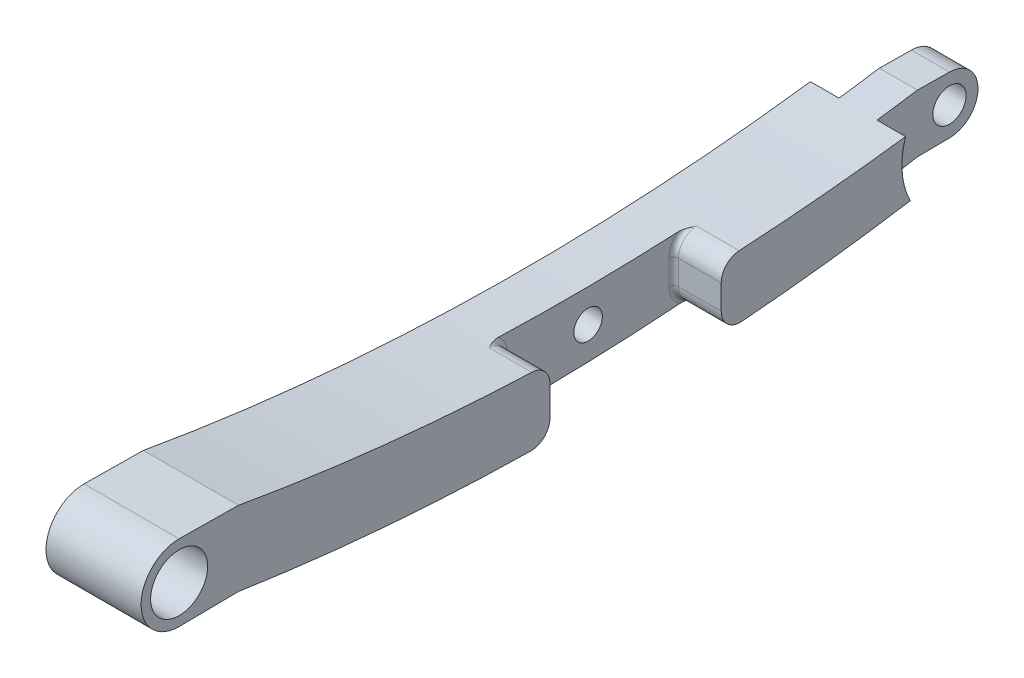
ISO-10303-21;
HEADER;
FILE_DESCRIPTION(('STEP AP214'),'2;1');
FILE_NAME('part.step','',(''),(''),'','','');
FILE_SCHEMA(('AUTOMOTIVE_DESIGN { 1 0 10303 214 1 1 1 1 }'));
ENDSEC;
DATA;
#1=APPLICATION_CONTEXT('core data for automotive mechanical design processes');
#2=APPLICATION_PROTOCOL_DEFINITION('international standard','automotive_design',2000,#1);
#3=PRODUCT_CONTEXT('',#1,'mechanical');
#4=PRODUCT('Part','Part','',(#3));
#5=PRODUCT_RELATED_PRODUCT_CATEGORY('part','',(#4));
#6=PRODUCT_DEFINITION_FORMATION('','',#4);
#7=PRODUCT_DEFINITION_CONTEXT('part definition',#1,'design');
#8=PRODUCT_DEFINITION('design','',#6,#7);
#9=PRODUCT_DEFINITION_SHAPE('','',#8);
#10=(LENGTH_UNIT() NAMED_UNIT(*) SI_UNIT(.MILLI.,.METRE.));
#11=(NAMED_UNIT(*) PLANE_ANGLE_UNIT() SI_UNIT($,.RADIAN.));
#12=(NAMED_UNIT(*) SI_UNIT($,.STERADIAN.) SOLID_ANGLE_UNIT());
#13=UNCERTAINTY_MEASURE_WITH_UNIT(LENGTH_MEASURE(1.E-05),#10,'distance_accuracy_value','');
#14=(GEOMETRIC_REPRESENTATION_CONTEXT(3) GLOBAL_UNCERTAINTY_ASSIGNED_CONTEXT((#13)) GLOBAL_UNIT_ASSIGNED_CONTEXT((#10,
#11,#12)) REPRESENTATION_CONTEXT('',''));
#15=CARTESIAN_POINT('',(0.,0.,0.));
#16=DIRECTION('',(0.,0.,1.));
#17=DIRECTION('',(1.,0.,0.));
#18=AXIS2_PLACEMENT_3D('',#15,#16,#17);
#19=CARTESIAN_POINT('',(10.,5.99925691325484,85.4744706411542));
#20=DIRECTION('',(1.,0.,0.));
#21=DIRECTION('',(0.,0.,-1.));
#22=AXIS2_PLACEMENT_3D('',#19,#20,#21);
#23=PLANE('',#22);
#24=DIRECTION('',(0.,1.,0.));
#25=VECTOR('',#24,1.);
#26=CARTESIAN_POINT('',(10.,-0.527832467467765,46.4744706411542));
#27=LINE('',#26,#25);
#28=CARTESIAN_POINT('',(10.,1.50267477132526,46.4744706411542));
#29=VERTEX_POINT('',#28);
#30=CARTESIAN_POINT('',(10.,4.61793473640981,46.4744706411542));
#31=VERTEX_POINT('',#30);
#32=EDGE_CURVE('E245',#29,#31,#27,.T.);
#33=ORIENTED_EDGE('',*,*,#32,.T.);
#34=CARTESIAN_POINT('',(10.,4.61793473640981,48.4744706411542));
#35=DIRECTION('',(1.,0.,0.));
#36=DIRECTION('',(0.,0.,-1.));
#37=AXIS2_PLACEMENT_3D('',#34,#35,#36);
#38=CIRCLE('',#37,2.);
#39=CARTESIAN_POINT('',(10.,6.61638429736786,48.3957346753792));
#40=VERTEX_POINT('',#39);
#41=EDGE_CURVE('E257',#31,#40,#38,.T.);
#42=ORIENTED_EDGE('',*,*,#41,.T.);
#43=CARTESIAN_POINT('',(10.,236.438083807545,39.3410986112443));
#44=DIRECTION('',(-1.,0.,0.));
#45=DIRECTION('',(0.,0.,1.));
#46=AXIS2_PLACEMENT_3D('',#43,#44,#45);
#47=CIRCLE('',#46,230.);
#48=CARTESIAN_POINT('',(10.,9.92502379326693,79.2388885621695));
#49=VERTEX_POINT('',#48);
#50=EDGE_CURVE('E417',#40,#49,#47,.T.);
#51=ORIENTED_EDGE('',*,*,#50,.T.);
#52=DIRECTION('',(0.,0.0119039184030142,0.999929145853172));
#53=VECTOR('',#52,1.);
#54=CARTESIAN_POINT('',(10.,9.99925691325485,85.4744706411542));
#55=LINE('',#54,#53);
#56=CARTESIAN_POINT('',(10.,9.99925691325485,85.4744706411542));
#57=VERTEX_POINT('',#56);
#58=EDGE_CURVE('E419',#49,#57,#55,.T.);
#59=ORIENTED_EDGE('',*,*,#58,.T.);
#60=CARTESIAN_POINT('',(10.,5.99925691325484,85.4744706411542));
#61=DIRECTION('',(1.,0.,0.));
#62=DIRECTION('',(0.,0.,-1.));
#63=AXIS2_PLACEMENT_3D('',#60,#61,#62);
#64=CIRCLE('',#63,4.);
#65=CARTESIAN_POINT('',(10.,1.99925691325484,85.4744706411542));
#66=VERTEX_POINT('',#65);
#67=EDGE_CURVE('E407',#57,#66,#64,.T.);
#68=ORIENTED_EDGE('',*,*,#67,.T.);
#69=DIRECTION('',(0.,0.0119039184030131,-0.999929145853172));
#70=VECTOR('',#69,1.);
#71=CARTESIAN_POINT('',(10.,1.99925691325484,85.4744706411542));
#72=LINE('',#71,#70);
#73=CARTESIAN_POINT('',(10.,2.07349003324278,79.2388885621696));
#74=VERTEX_POINT('',#73);
#75=EDGE_CURVE('E410',#66,#74,#72,.T.);
#76=ORIENTED_EDGE('',*,*,#75,.T.);
#77=CARTESIAN_POINT('',(10.,229.472167532532,44.7448097721201));
#78=DIRECTION('',(1.,0.,0.));
#79=DIRECTION('',(0.,0.,-1.));
#80=AXIS2_PLACEMENT_3D('',#77,#78,#79);
#81=CIRCLE('',#80,230.);
#82=CARTESIAN_POINT('',(10.,-0.49705762131691,48.5071869645668));
#83=VERTEX_POINT('',#82);
#84=EDGE_CURVE('E414',#74,#83,#81,.T.);
#85=ORIENTED_EDGE('',*,*,#84,.T.);
#86=CARTESIAN_POINT('',(10.,1.50267477132526,48.4744706411542));
#87=DIRECTION('',(1.,0.,0.));
#88=DIRECTION('',(0.,0.,-1.));
#89=AXIS2_PLACEMENT_3D('',#86,#87,#88);
#90=CIRCLE('',#89,2.);
#91=EDGE_CURVE('E255',#83,#29,#90,.T.);
#92=ORIENTED_EDGE('',*,*,#91,.T.);
#93=EDGE_LOOP('',(#33,#42,#51,#59,#68,#76,#85,#92));
#94=FACE_BOUND('',#93,.T.);
#95=CARTESIAN_POINT('',(10.,5.99925691325484,85.4744706411542));
#96=DIRECTION('',(1.,0.,0.));
#97=DIRECTION('',(0.,0.,-1.));
#98=AXIS2_PLACEMENT_3D('',#95,#96,#97);
#99=CIRCLE('',#98,2.99999999999999);
#100=CARTESIAN_POINT('',(10.,5.99925691325484,82.4744706411543));
#101=VERTEX_POINT('',#100);
#102=EDGE_CURVE('E398',#101,#101,#99,.T.);
#103=ORIENTED_EDGE('',*,*,#102,.F.);
#104=EDGE_LOOP('',(#103));
#105=FACE_BOUND('',#104,.T.);
#106=ADVANCED_FACE('F35',(#94,#105),#23,.T.);
#107=CARTESIAN_POINT('',(10.,8.43558120150407,9.09446565181447));
#108=VERTEX_POINT('',#107);
#109=CARTESIAN_POINT('',(10.,6.79206948562802,26.5853898477929));
#110=VERTEX_POINT('',#109);
#111=EDGE_CURVE('E227',#108,#110,#47,.T.);
#112=ORIENTED_EDGE('',*,*,#111,.T.);
#113=CARTESIAN_POINT('',(10.,4.79514762195921,26.4744706411542));
#114=DIRECTION('',(1.,0.,0.));
#115=DIRECTION('',(0.,0.,-1.));
#116=AXIS2_PLACEMENT_3D('',#113,#114,#115);
#117=CIRCLE('',#116,2.);
#118=CARTESIAN_POINT('',(10.,4.79514762195921,28.4744706411542));
#119=VERTEX_POINT('',#118);
#120=EDGE_CURVE('E265',#110,#119,#117,.T.);
#121=ORIENTED_EDGE('',*,*,#120,.T.);
#122=DIRECTION('',(0.,1.,0.));
#123=VECTOR('',#122,1.);
#124=CARTESIAN_POINT('',(10.,-0.527832467467765,28.4744706411542));
#125=LINE('',#124,#123);
#126=CARTESIAN_POINT('',(10.,2.2053756159843,28.4744706411542));
#127=VERTEX_POINT('',#126);
#128=EDGE_CURVE('E517',#127,#119,#125,.T.);
#129=ORIENTED_EDGE('',*,*,#128,.F.);
#130=CARTESIAN_POINT('',(10.,2.2053756159843,26.4744706411542));
#131=DIRECTION('',(1.,0.,0.));
#132=DIRECTION('',(0.,0.,-1.));
#133=AXIS2_PLACEMENT_3D('',#130,#131,#132);
#134=CIRCLE('',#133,2.);
#135=CARTESIAN_POINT('',(10.,0.211807265839137,26.3142045084265));
#136=VERTEX_POINT('',#135);
#137=EDGE_CURVE('E263',#127,#136,#134,.T.);
#138=ORIENTED_EDGE('',*,*,#137,.T.);
#139=CARTESIAN_POINT('',(10.,2.332468437345,8.58465082684114));
#140=VERTEX_POINT('',#139);
#141=EDGE_CURVE('E413',#136,#140,#81,.T.);
#142=ORIENTED_EDGE('',*,*,#141,.T.);
#143=CARTESIAN_POINT('',(10.,5.99925691325484,1.47447064115423));
#144=DIRECTION('',(1.,0.,0.));
#145=DIRECTION('',(0.,0.,-1.));
#146=AXIS2_PLACEMENT_3D('',#143,#144,#145);
#147=CIRCLE('',#146,8.);
#148=EDGE_CURVE('E220',#108,#140,#147,.T.);
#149=ORIENTED_EDGE('',*,*,#148,.F.);
#150=EDGE_LOOP('',(#112,#121,#129,#138,#142,#149));
#151=FACE_BOUND('',#150,.T.);
#152=ADVANCED_FACE('F365',(#151),#23,.T.);
#153=CARTESIAN_POINT('',(0.,5.99925691325484,85.4744706411542));
#154=DIRECTION('',(1.,0.,0.));
#155=DIRECTION('',(0.,0.,-1.));
#156=AXIS2_PLACEMENT_3D('',#153,#154,#155);
#157=PLANE('',#156);
#158=CARTESIAN_POINT('',(0.,2.99925691325484,37.4744706411542));
#159=DIRECTION('',(1.,0.,0.));
#160=DIRECTION('',(0.,0.,-1.));
#161=AXIS2_PLACEMENT_3D('',#158,#159,#160);
#162=CIRCLE('',#161,1.5);
#163=CARTESIAN_POINT('',(0.,2.99925691325484,35.9744706411542));
#164=VERTEX_POINT('',#163);
#165=EDGE_CURVE('E221',#164,#164,#162,.T.);
#166=ORIENTED_EDGE('',*,*,#165,.T.);
#167=EDGE_LOOP('',(#166));
#168=FACE_BOUND('',#167,.T.);
#169=CARTESIAN_POINT('',(0.,236.438083807545,39.3410986112443));
#170=DIRECTION('',(-1.,0.,0.));
#171=DIRECTION('',(0.,0.,1.));
#172=AXIS2_PLACEMENT_3D('',#169,#170,#171);
#173=CIRCLE('',#172,230.);
#174=CARTESIAN_POINT('',(0.,8.43558120150407,9.09446565181447));
#175=VERTEX_POINT('',#174);
#176=CARTESIAN_POINT('',(0.,9.92502379326693,79.2388885621695));
#177=VERTEX_POINT('',#176);
#178=EDGE_CURVE('E393',#175,#177,#173,.T.);
#179=ORIENTED_EDGE('',*,*,#178,.F.);
#180=CARTESIAN_POINT('',(0.,5.99925691325484,1.47447064115423));
#181=DIRECTION('',(1.,0.,0.));
#182=DIRECTION('',(0.,0.,-1.));
#183=AXIS2_PLACEMENT_3D('',#180,#181,#182);
#184=CIRCLE('',#183,8.);
#185=CARTESIAN_POINT('',(0.,2.332468437345,8.58465082684114));
#186=VERTEX_POINT('',#185);
#187=EDGE_CURVE('E448',#175,#186,#184,.T.);
#188=ORIENTED_EDGE('',*,*,#187,.T.);
#189=CARTESIAN_POINT('',(0.,229.472167532532,44.7448097721201));
#190=DIRECTION('',(1.,0.,0.));
#191=DIRECTION('',(0.,0.,-1.));
#192=AXIS2_PLACEMENT_3D('',#189,#190,#191);
#193=CIRCLE('',#192,230.);
#194=CARTESIAN_POINT('',(0.,2.07349003324278,79.2388885621696));
#195=VERTEX_POINT('',#194);
#196=EDGE_CURVE('E426',#195,#186,#193,.T.);
#197=ORIENTED_EDGE('',*,*,#196,.F.);
#198=DIRECTION('',(0.,0.0119039184030131,-0.999929145853172));
#199=VECTOR('',#198,1.);
#200=CARTESIAN_POINT('',(0.,1.99925691325484,85.4744706411542));
#201=LINE('',#200,#199);
#202=CARTESIAN_POINT('',(0.,1.99925691325484,85.4744706411542));
#203=VERTEX_POINT('',#202);
#204=EDGE_CURVE('E424',#203,#195,#201,.T.);
#205=ORIENTED_EDGE('',*,*,#204,.F.);
#206=CARTESIAN_POINT('',(0.,5.99925691325484,85.4744706411542));
#207=DIRECTION('',(1.,0.,0.));
#208=DIRECTION('',(0.,0.,-1.));
#209=AXIS2_PLACEMENT_3D('',#206,#207,#208);
#210=CIRCLE('',#209,4.);
#211=CARTESIAN_POINT('',(0.,9.99925691325485,85.4744706411542));
#212=VERTEX_POINT('',#211);
#213=EDGE_CURVE('E402',#212,#203,#210,.T.);
#214=ORIENTED_EDGE('',*,*,#213,.F.);
#215=DIRECTION('',(0.,0.0119039184030142,0.999929145853172));
#216=VECTOR('',#215,1.);
#217=CARTESIAN_POINT('',(0.,9.99925691325485,85.4744706411542));
#218=LINE('',#217,#216);
#219=EDGE_CURVE('E411',#177,#212,#218,.T.);
#220=ORIENTED_EDGE('',*,*,#219,.F.);
#221=EDGE_LOOP('',(#179,#188,#197,#205,#214,#220));
#222=FACE_BOUND('',#221,.T.);
#223=CARTESIAN_POINT('',(0.,5.99925691325484,85.4744706411542));
#224=DIRECTION('',(1.,0.,0.));
#225=DIRECTION('',(0.,0.,-1.));
#226=AXIS2_PLACEMENT_3D('',#223,#224,#225);
#227=CIRCLE('',#226,2.99999999999999);
#228=CARTESIAN_POINT('',(0.,5.99925691325484,82.4744706411543));
#229=VERTEX_POINT('',#228);
#230=EDGE_CURVE('E396',#229,#229,#227,.T.);
#231=ORIENTED_EDGE('',*,*,#230,.T.);
#232=EDGE_LOOP('',(#231));
#233=FACE_BOUND('',#232,.T.);
#234=ADVANCED_FACE('F371',(#168,#222,#233),#157,.F.);
#235=CARTESIAN_POINT('',(10.,5.99925691325484,85.4744706411542));
#236=DIRECTION('',(-1.,0.,0.));
#237=DIRECTION('',(0.,0.,1.));
#238=AXIS2_PLACEMENT_3D('',#235,#236,#237);
#239=CYLINDRICAL_SURFACE('',#238,4.);
#240=ORIENTED_EDGE('',*,*,#213,.T.);
#241=DIRECTION('',(-1.,0.,0.));
#242=VECTOR('',#241,1.);
#243=CARTESIAN_POINT('',(10.,1.99925691325484,85.4744706411542));
#244=LINE('',#243,#242);
#245=EDGE_CURVE('E229',#66,#203,#244,.T.);
#246=ORIENTED_EDGE('',*,*,#245,.F.);
#247=ORIENTED_EDGE('',*,*,#67,.F.);
#248=DIRECTION('',(-1.,0.,0.));
#249=VECTOR('',#248,1.);
#250=CARTESIAN_POINT('',(10.,9.99925691325485,85.4744706411542));
#251=LINE('',#250,#249);
#252=EDGE_CURVE('E421',#57,#212,#251,.T.);
#253=ORIENTED_EDGE('',*,*,#252,.T.);
#254=EDGE_LOOP('',(#240,#246,#247,#253));
#255=FACE_BOUND('',#254,.T.);
#256=ADVANCED_FACE('F379',(#255),#239,.T.);
#257=CARTESIAN_POINT('',(10.,1.99925691325484,85.4744706411542));
#258=DIRECTION('',(0.,0.999929145853172,0.0119039184030131));
#259=DIRECTION('',(0.,-0.0119039184030131,0.999929145853172));
#260=AXIS2_PLACEMENT_3D('',#257,#258,#259);
#261=PLANE('',#260);
#262=ORIENTED_EDGE('',*,*,#204,.T.);
#263=DIRECTION('',(-1.,0.,0.));
#264=VECTOR('',#263,1.);
#265=CARTESIAN_POINT('',(10.,2.07349003324278,79.2388885621696));
#266=LINE('',#265,#264);
#267=EDGE_CURVE('E235',#74,#195,#266,.T.);
#268=ORIENTED_EDGE('',*,*,#267,.F.);
#269=ORIENTED_EDGE('',*,*,#75,.F.);
#270=ORIENTED_EDGE('',*,*,#245,.T.);
#271=EDGE_LOOP('',(#262,#268,#269,#270));
#272=FACE_BOUND('',#271,.T.);
#273=ADVANCED_FACE('F361',(#272),#261,.F.);
#274=CARTESIAN_POINT('',(10.,229.472167532532,44.7448097721201));
#275=DIRECTION('',(-1.,0.,0.));
#276=DIRECTION('',(0.,0.,1.));
#277=AXIS2_PLACEMENT_3D('',#274,#275,#276);
#278=CYLINDRICAL_SURFACE('',#277,230.);
#279=DIRECTION('',(-1.,0.,0.));
#280=VECTOR('',#279,1.);
#281=CARTESIAN_POINT('',(10.,0.211807265839137,26.3142045084265));
#282=LINE('',#281,#280);
#283=CARTESIAN_POINT('',(5.5,0.211807265839137,26.3142045084265));
#284=VERTEX_POINT('',#283);
#285=EDGE_CURVE('E259',#136,#284,#282,.T.);
#286=ORIENTED_EDGE('',*,*,#285,.T.);
#287=CARTESIAN_POINT('',(5.,0.0960006166005937,27.8163115825385));
#288=CARTESIAN_POINT('',(5.00003653148031,0.0999328474462259,27.7630289223174));
#289=CARTESIAN_POINT('',(5.0030504474986,0.103876419589365,27.7098495890329));
#290=CARTESIAN_POINT('',(5.01404793962375,0.111750853201533,27.6041551490793));
#291=CARTESIAN_POINT('',(5.02201645468668,0.115681717033659,27.5516385197322));
#292=CARTESIAN_POINT('',(5.0418220092266,0.1234690917251,27.4480703748097));
#293=CARTESIAN_POINT('',(5.05360805826025,0.127325909180655,27.3970087052203));
#294=CARTESIAN_POINT('',(5.08036548393096,0.135012320526153,27.295688861239));
#295=CARTESIAN_POINT('',(5.09533958587684,0.138841888208609,27.24543141411));
#296=CARTESIAN_POINT('',(5.1362072946181,0.148433166416189,27.1200942709416));
#297=CARTESIAN_POINT('',(5.16375363452504,0.154174543699972,27.0455564937093));
#298=CARTESIAN_POINT('',(5.2229227416069,0.165603415980485,26.8980981616599));
#299=CARTESIAN_POINT('',(5.25454810852117,0.171290874108928,26.8251786732895));
#300=CARTESIAN_POINT('',(5.35351245934359,0.188356846452073,26.6076804852164));
#301=CARTESIAN_POINT('',(5.42473863521482,0.199697502831968,26.4649030314157));
#302=CARTESIAN_POINT('',(5.4973310330088,0.211377693790626,26.3195485952608));
#303=CARTESIAN_POINT('',(5.49866552781479,0.211592457352102,26.3168765427223));
#304=CARTESIAN_POINT('',(5.5,0.211807265839143,26.3142045084265));
#305=B_SPLINE_CURVE_WITH_KNOTS('',3,(#287,#288,#289,#290,#291,#292,#293,#294,#295,#296,#297,
#298,#299,#300,#301,#302,#303,#304),.UNSPECIFIED.,.F.,.F.,(4,2,2,2,2,2,2,2,4),(0.,
0.160055796851825,0.319627417122591,0.477149947554463,0.634807680801498,0.873634829903559,
1.11261495301298,1.59230568562979,1.60128910114968),.UNSPECIFIED.);
#306=CARTESIAN_POINT('',(5.,0.0960006166005889,27.8163115825385));
#307=VERTEX_POINT('',#306);
#308=EDGE_CURVE('E11',#284,#307,#305,.F.);
#309=ORIENTED_EDGE('',*,*,#308,.T.);
#310=CARTESIAN_POINT('',(5.00000000000001,229.472167532532,44.7448097721201));
#311=DIRECTION('',(-1.,0.,0.));
#312=DIRECTION('',(0.,0.,1.));
#313=AXIS2_PLACEMENT_3D('',#310,#311,#312);
#314=CIRCLE('',#313,230.);
#315=CARTESIAN_POINT('',(5.00000000000001,-0.516768565896081,47.0007513301074));
#316=VERTEX_POINT('',#315);
#317=EDGE_CURVE('E536',#307,#316,#314,.T.);
#318=ORIENTED_EDGE('',*,*,#317,.T.);
#319=CARTESIAN_POINT('',(5.00000000000001,-0.516768565896086,47.0007513301074));
#320=CARTESIAN_POINT('',(5.00003653148032,-0.516244678593613,47.0541763229647));
#321=CARTESIAN_POINT('',(5.00305044749866,-0.515702879118216,47.1074989232691));
#322=CARTESIAN_POINT('',(5.01404793962398,-0.51458957612369,47.2134804400464));
#323=CARTESIAN_POINT('',(5.02201645468702,-0.514018167418703,47.2661408762446));
#324=CARTESIAN_POINT('',(5.04182200922706,-0.512856052568479,47.3699948763424));
#325=CARTESIAN_POINT('',(5.05360805826066,-0.512265688448513,47.4211985931245));
#326=CARTESIAN_POINT('',(5.08036548393119,-0.511060851800227,47.5228024319903));
#327=CARTESIAN_POINT('',(5.09533958587693,-0.510446359014389,47.573201826621));
#328=CARTESIAN_POINT('',(5.13620729461819,-0.508873245204494,47.6988955710479));
#329=CARTESIAN_POINT('',(5.1637536345254,-0.507900332457753,47.7736478090652));
#330=CARTESIAN_POINT('',(5.22292274160638,-0.505905073480107,47.9215349205863));
#331=CARTESIAN_POINT('',(5.25454810851949,-0.50488269598513,47.9946687274643));
#332=CARTESIAN_POINT('',(5.35351245934627,-0.501731546044344,48.2128126695764));
#333=CARTESIAN_POINT('',(5.42473863523072,-0.499525604538052,48.3560228145423));
#334=CARTESIAN_POINT('',(5.49733103300931,-0.497145275285102,48.5018263570429));
#335=CARTESIAN_POINT('',(5.49866552781506,-0.497101471300094,48.5045066684741));
#336=CARTESIAN_POINT('',(5.50000000000001,-0.497057621316903,48.5071869645668));
#337=B_SPLINE_CURVE_WITH_KNOTS('',3,(#319,#320,#321,#322,#323,#324,#325,#326,#327,#328,#329,
#330,#331,#332,#333,#334,#335,#336),.UNSPECIFIED.,.F.,.F.,(4,2,2,2,2,2,2,2,4),(0.,
0.16005579685324,0.319627417125112,0.477149947555681,0.634807680801564,0.87363482990331,
1.11261495301211,1.59230568562948,1.60128910114968),.UNSPECIFIED.);
#338=CARTESIAN_POINT('',(5.50000000000001,-0.49705762131691,48.5071869645668));
#339=VERTEX_POINT('',#338);
#340=EDGE_CURVE('E295',#316,#339,#337,.T.);
#341=ORIENTED_EDGE('',*,*,#340,.T.);
#342=DIRECTION('',(-1.,0.,0.));
#343=VECTOR('',#342,1.);
#344=CARTESIAN_POINT('',(10.,-0.49705762131691,48.5071869645668));
#345=LINE('',#344,#343);
#346=EDGE_CURVE('E261',#339,#83,#345,.F.);
#347=ORIENTED_EDGE('',*,*,#346,.T.);
#348=ORIENTED_EDGE('',*,*,#84,.F.);
#349=ORIENTED_EDGE('',*,*,#267,.T.);
#350=ORIENTED_EDGE('',*,*,#196,.T.);
#351=DIRECTION('',(1.,0.,0.));
#352=VECTOR('',#351,1.);
#353=CARTESIAN_POINT('',(1.5,2.33246843734496,8.58465082684113));
#354=LINE('',#353,#352);
#355=CARTESIAN_POINT('',(3.,2.33246843734509,8.58465082684119));
#356=VERTEX_POINT('',#355);
#357=EDGE_CURVE('E399',#186,#356,#354,.T.);
#358=ORIENTED_EDGE('',*,*,#357,.T.);
#359=CARTESIAN_POINT('',(3.,229.472167532532,44.7448097721201));
#360=DIRECTION('',(1.,0.,0.));
#361=DIRECTION('',(0.,0.,-1.));
#362=AXIS2_PLACEMENT_3D('',#359,#360,#361);
#363=CIRCLE('',#362,230.);
#364=CARTESIAN_POINT('',(3.,2.95910751825436,4.8470198211949));
#365=VERTEX_POINT('',#364);
#366=EDGE_CURVE('E480',#356,#365,#363,.T.);
#367=ORIENTED_EDGE('',*,*,#366,.T.);
#368=DIRECTION('',(-1.,0.,0.));
#369=VECTOR('',#368,1.);
#370=CARTESIAN_POINT('',(10.,2.95910751825436,4.8470198211949));
#371=LINE('',#370,#369);
#372=CARTESIAN_POINT('',(7.,2.95910751825436,4.8470198211949));
#373=VERTEX_POINT('',#372);
#374=EDGE_CURVE('E444',#373,#365,#371,.T.);
#375=ORIENTED_EDGE('',*,*,#374,.F.);
#376=CARTESIAN_POINT('',(7.,229.472167532532,44.7448097721201));
#377=DIRECTION('',(-1.,0.,0.));
#378=DIRECTION('',(0.,0.,1.));
#379=AXIS2_PLACEMENT_3D('',#376,#377,#378);
#380=CIRCLE('',#379,230.);
#381=CARTESIAN_POINT('',(7.,2.33246843734509,8.58465082684119));
#382=VERTEX_POINT('',#381);
#383=EDGE_CURVE('E466',#373,#382,#380,.T.);
#384=ORIENTED_EDGE('',*,*,#383,.T.);
#385=DIRECTION('',(1.,0.,0.));
#386=VECTOR('',#385,1.);
#387=CARTESIAN_POINT('',(8.5,2.33246843734496,8.58465082684113));
#388=LINE('',#387,#386);
#389=EDGE_CURVE('E219',#382,#140,#388,.T.);
#390=ORIENTED_EDGE('',*,*,#389,.T.);
#391=ORIENTED_EDGE('',*,*,#141,.F.);
#392=EDGE_LOOP('',(#286,#309,#318,#341,#347,#348,#349,#350,#358,#367,#375,#384,#390,#391));
#393=FACE_BOUND('',#392,.T.);
#394=ADVANCED_FACE('F309',(#393),#278,.T.);
#395=CARTESIAN_POINT('',(10.,2.95910751825436,4.8470198211949));
#396=DIRECTION('',(0.,0.999929145853172,0.0119039184030127));
#397=DIRECTION('',(0.,-0.0119039184030127,0.999929145853172));
#398=AXIS2_PLACEMENT_3D('',#395,#396,#397);
#399=PLANE('',#398);
#400=ORIENTED_EDGE('',*,*,#374,.T.);
#401=DIRECTION('',(0.,0.0119039184030127,-0.999929145853172));
#402=VECTOR('',#401,1.);
#403=CARTESIAN_POINT('',(3.,2.95910751825436,4.8470198211949));
#404=LINE('',#403,#402);
#405=CARTESIAN_POINT('',(3.,2.99925691325484,1.47447064115423));
#406=VERTEX_POINT('',#405);
#407=EDGE_CURVE('E477',#365,#406,#404,.T.);
#408=ORIENTED_EDGE('',*,*,#407,.T.);
#409=DIRECTION('',(-1.,0.,0.));
#410=VECTOR('',#409,1.);
#411=CARTESIAN_POINT('',(10.,2.99925691325484,1.47447064115423));
#412=LINE('',#411,#410);
#413=CARTESIAN_POINT('',(7.,2.99925691325484,1.47447064115423));
#414=VERTEX_POINT('',#413);
#415=EDGE_CURVE('E441',#414,#406,#412,.T.);
#416=ORIENTED_EDGE('',*,*,#415,.F.);
#417=DIRECTION('',(0.,-0.0119039184030127,0.999929145853172));
#418=VECTOR('',#417,1.);
#419=CARTESIAN_POINT('',(7.,2.95910751825436,4.8470198211949));
#420=LINE('',#419,#418);
#421=EDGE_CURVE('E463',#414,#373,#420,.T.);
#422=ORIENTED_EDGE('',*,*,#421,.T.);
#423=EDGE_LOOP('',(#400,#408,#416,#422));
#424=FACE_BOUND('',#423,.T.);
#425=ADVANCED_FACE('F354',(#424),#399,.F.);
#426=CARTESIAN_POINT('',(10.,5.99925691325484,1.47447064115423));
#427=DIRECTION('',(-1.,0.,0.));
#428=DIRECTION('',(0.,0.,1.));
#429=AXIS2_PLACEMENT_3D('',#426,#427,#428);
#430=CYLINDRICAL_SURFACE('',#429,3.);
#431=ORIENTED_EDGE('',*,*,#415,.T.);
#432=CARTESIAN_POINT('',(3.,5.99925691325484,1.47447064115423));
#433=DIRECTION('',(1.,0.,0.));
#434=DIRECTION('',(0.,0.,-1.));
#435=AXIS2_PLACEMENT_3D('',#432,#433,#434);
#436=CIRCLE('',#435,3.);
#437=CARTESIAN_POINT('',(3.,8.99925691325484,1.47447064115423));
#438=VERTEX_POINT('',#437);
#439=EDGE_CURVE('E474',#406,#438,#436,.T.);
#440=ORIENTED_EDGE('',*,*,#439,.T.);
#441=DIRECTION('',(-1.,0.,0.));
#442=VECTOR('',#441,1.);
#443=CARTESIAN_POINT('',(10.,8.99925691325484,1.47447064115423));
#444=LINE('',#443,#442);
#445=CARTESIAN_POINT('',(7.,8.99925691325484,1.47447064115423));
#446=VERTEX_POINT('',#445);
#447=EDGE_CURVE('E438',#446,#438,#444,.T.);
#448=ORIENTED_EDGE('',*,*,#447,.F.);
#449=CARTESIAN_POINT('',(7.,5.99925691325484,1.47447064115423));
#450=DIRECTION('',(-1.,0.,0.));
#451=DIRECTION('',(0.,0.,1.));
#452=AXIS2_PLACEMENT_3D('',#449,#450,#451);
#453=CIRCLE('',#452,3.);
#454=EDGE_CURVE('E460',#446,#414,#453,.T.);
#455=ORIENTED_EDGE('',*,*,#454,.T.);
#456=EDGE_LOOP('',(#431,#440,#448,#455));
#457=FACE_BOUND('',#456,.T.);
#458=ADVANCED_FACE('F351',(#457),#430,.T.);
#459=CARTESIAN_POINT('',(10.,9.03940630825532,4.84701982119488));
#460=DIRECTION('',(0.,-0.999929145853172,0.0119039184030128));
#461=DIRECTION('',(0.,-0.0119039184030128,-0.999929145853172));
#462=AXIS2_PLACEMENT_3D('',#459,#460,#461);
#463=PLANE('',#462);
#464=ORIENTED_EDGE('',*,*,#447,.T.);
#465=DIRECTION('',(0.,0.0119039184030128,0.999929145853172));
#466=VECTOR('',#465,1.);
#467=CARTESIAN_POINT('',(3.,9.03940630825532,4.84701982119488));
#468=LINE('',#467,#466);
#469=CARTESIAN_POINT('',(3.,9.03940630825537,4.84701982119474));
#470=VERTEX_POINT('',#469);
#471=EDGE_CURVE('E471',#438,#470,#468,.T.);
#472=ORIENTED_EDGE('',*,*,#471,.T.);
#473=DIRECTION('',(-1.,0.,0.));
#474=VECTOR('',#473,1.);
#475=CARTESIAN_POINT('',(10.,9.03940630825537,4.84701982119474));
#476=LINE('',#475,#474);
#477=CARTESIAN_POINT('',(7.,9.03940630825537,4.84701982119474));
#478=VERTEX_POINT('',#477);
#479=EDGE_CURVE('E436',#478,#470,#476,.T.);
#480=ORIENTED_EDGE('',*,*,#479,.F.);
#481=DIRECTION('',(0.,-0.0119039184030128,-0.999929145853172));
#482=VECTOR('',#481,1.);
#483=CARTESIAN_POINT('',(7.,9.03940630825532,4.84701982119488));
#484=LINE('',#483,#482);
#485=EDGE_CURVE('E206',#478,#446,#484,.T.);
#486=ORIENTED_EDGE('',*,*,#485,.T.);
#487=EDGE_LOOP('',(#464,#472,#480,#486));
#488=FACE_BOUND('',#487,.T.);
#489=ADVANCED_FACE('F346',(#488),#463,.F.);
#490=CARTESIAN_POINT('',(10.,236.438083807545,39.3410986112443));
#491=DIRECTION('',(-1.,0.,0.));
#492=DIRECTION('',(0.,0.,1.));
#493=AXIS2_PLACEMENT_3D('',#490,#491,#492);
#494=CYLINDRICAL_SURFACE('',#493,230.);
#495=ORIENTED_EDGE('',*,*,#50,.F.);
#496=DIRECTION('',(-1.,0.,0.));
#497=VECTOR('',#496,1.);
#498=CARTESIAN_POINT('',(10.,6.61638429736786,48.3957346753792));
#499=LINE('',#498,#497);
#500=CARTESIAN_POINT('',(5.50000000000001,6.61638429736786,48.3957346753792));
#501=VERTEX_POINT('',#500);
#502=EDGE_CURVE('E247',#40,#501,#499,.T.);
#503=ORIENTED_EDGE('',*,*,#502,.T.);
#504=CARTESIAN_POINT('',(5.00000000000001,6.56243309704369,46.9031889587395));
#505=CARTESIAN_POINT('',(5.00003560243469,6.56416504259981,46.9558419698141));
#506=CARTESIAN_POINT('',(5.00301796296755,6.56591203967754,47.0083930806561));
#507=CARTESIAN_POINT('',(5.0139024725649,6.56941954197315,47.1128353102335));
#508=CARTESIAN_POINT('',(5.02178959901536,6.57117998979107,47.1647279523672));
#509=CARTESIAN_POINT('',(5.04139367473347,6.57468557864511,47.2670527670712));
#510=CARTESIAN_POINT('',(5.05305955100819,6.57643062151307,47.3174951545688));
#511=CARTESIAN_POINT('',(5.07954583348782,6.57992547683012,47.4175802835514));
#512=CARTESIAN_POINT('',(5.09436896014466,6.58167529209949,47.4672222954554));
#513=CARTESIAN_POINT('',(5.13509058719521,6.58610694036279,47.5918213336559));
#514=CARTESIAN_POINT('',(5.16268961144486,6.58879010540719,47.6662179090186));
#515=CARTESIAN_POINT('',(5.22200476489552,6.59416697681074,47.8133657164512));
#516=CARTESIAN_POINT('',(5.25372361487592,6.59686068898495,47.8861158235584));
#517=CARTESIAN_POINT('',(5.35300650010015,6.60499518334872,48.1030889870573));
#518=CARTESIAN_POINT('',(5.42449016436994,6.61046956230029,48.2454809998734));
#519=CARTESIAN_POINT('',(5.49733567126347,6.61617547030568,48.3904331171685));
#520=CARTESIAN_POINT('',(5.49866784723669,6.61627986150341,48.393083904435));
#521=CARTESIAN_POINT('',(5.50000000000001,6.61638429736787,48.3957346753791));
#522=B_SPLINE_CURVE_WITH_KNOTS('',3,(#504,#505,#506,#507,#508,#509,#510,#511,#512,#513,#514,
#515,#516,#517,#518,#519,#520,#521),.UNSPECIFIED.,.F.,.F.,(4,2,2,2,2,2,2,2,4),(0.,
0.157819298903561,0.315157584030411,0.470452328724027,0.62588142875105,0.863875199580121,
1.10202695102996,1.58009943635221,1.58900507191982),.UNSPECIFIED.);
#523=CARTESIAN_POINT('',(5.00000000000001,6.56243309704369,46.9031889587395));
#524=VERTEX_POINT('',#523);
#525=EDGE_CURVE('E302',#501,#524,#522,.F.);
#526=ORIENTED_EDGE('',*,*,#525,.T.);
#527=CARTESIAN_POINT('',(5.,236.438083807545,39.3410986112443));
#528=DIRECTION('',(-1.,0.,0.));
#529=DIRECTION('',(0.,0.,1.));
#530=AXIS2_PLACEMENT_3D('',#527,#528,#529);
#531=CIRCLE('',#530,230.);
#532=CARTESIAN_POINT('',(5.,6.71408154316969,28.0768727773322));
#533=VERTEX_POINT('',#532);
#534=EDGE_CURVE('E244',#524,#533,#531,.F.);
#535=ORIENTED_EDGE('',*,*,#534,.T.);
#536=CARTESIAN_POINT('',(5.,6.71408154316969,28.0768727773322));
#537=CARTESIAN_POINT('',(5.00003560243469,6.71666146277044,28.0242544988957));
#538=CARTESIAN_POINT('',(5.00301796296769,6.71925479040667,27.9717383499372));
#539=CARTESIAN_POINT('',(5.01390247256552,6.72444432011032,27.8673661760911));
#540=CARTESIAN_POINT('',(5.02178959901628,6.72704048932596,27.815508627078));
#541=CARTESIAN_POINT('',(5.04139367473472,6.73219399594038,27.713253562524));
#542=CARTESIAN_POINT('',(5.05305955100929,6.73475139973822,27.6628458317999));
#543=CARTESIAN_POINT('',(5.07954583348837,6.73985809462491,27.5628299894346));
#544=CARTESIAN_POINT('',(5.09436896014481,6.74240737678069,27.5132226073253));
#545=CARTESIAN_POINT('',(5.13509058719537,6.74884564293857,27.3887111277124));
#546=CARTESIAN_POINT('',(5.16268961144584,6.7527269303925,27.3143674298762));
#547=CARTESIAN_POINT('',(5.22200476489411,6.76047354005517,27.1673253338043));
#548=CARTESIAN_POINT('',(5.2537236148713,6.76433884995593,27.0946280604791));
#549=CARTESIAN_POINT('',(5.35300650010794,6.77596755656217,26.8778140921621));
#550=CARTESIAN_POINT('',(5.42449016441502,6.78373504899076,26.7355287443745));
#551=CARTESIAN_POINT('',(5.4973356712653,6.79177528171156,26.5906873540235));
#552=CARTESIAN_POINT('',(5.49866784723761,6.7919223614708,26.5880385923884));
#553=CARTESIAN_POINT('',(5.5,6.79206948562805,26.5853898477929));
#554=B_SPLINE_CURVE_WITH_KNOTS('',3,(#536,#537,#538,#539,#540,#541,#542,#543,#544,#545,#546,
#547,#548,#549,#550,#551,#552,#553),.UNSPECIFIED.,.F.,.F.,(4,2,2,2,2,2,2,2,4),(0.,
0.157819298907441,0.315157584037314,0.470452328727225,0.625881428751008,0.863875199579657,
1.10202695102815,1.58009943635274,1.58900507191981),.UNSPECIFIED.);
#555=CARTESIAN_POINT('',(5.5,6.79206948562802,26.5853898477929));
#556=VERTEX_POINT('',#555);
#557=EDGE_CURVE('E45',#533,#556,#554,.T.);
#558=ORIENTED_EDGE('',*,*,#557,.T.);
#559=DIRECTION('',(-1.,0.,0.));
#560=VECTOR('',#559,1.);
#561=CARTESIAN_POINT('',(10.,6.79206948562802,26.5853898477929));
#562=LINE('',#561,#560);
#563=EDGE_CURVE('E232',#556,#110,#562,.F.);
#564=ORIENTED_EDGE('',*,*,#563,.T.);
#565=ORIENTED_EDGE('',*,*,#111,.F.);
#566=DIRECTION('',(1.,0.,0.));
#567=VECTOR('',#566,1.);
#568=CARTESIAN_POINT('',(8.5,8.4355812015039,9.09446565181452));
#569=LINE('',#568,#567);
#570=CARTESIAN_POINT('',(7.,8.43558120150426,9.09446565181441));
#571=VERTEX_POINT('',#570);
#572=EDGE_CURVE('E216',#108,#571,#569,.F.);
#573=ORIENTED_EDGE('',*,*,#572,.T.);
#574=CARTESIAN_POINT('',(7.,236.438083807545,39.3410986112443));
#575=DIRECTION('',(-1.,0.,0.));
#576=DIRECTION('',(0.,0.,1.));
#577=AXIS2_PLACEMENT_3D('',#574,#575,#576);
#578=CIRCLE('',#577,230.);
#579=EDGE_CURVE('E200',#571,#478,#578,.F.);
#580=ORIENTED_EDGE('',*,*,#579,.T.);
#581=ORIENTED_EDGE('',*,*,#479,.T.);
#582=CARTESIAN_POINT('',(3.,236.438083807545,39.3410986112443));
#583=DIRECTION('',(1.,0.,0.));
#584=DIRECTION('',(0.,0.,-1.));
#585=AXIS2_PLACEMENT_3D('',#582,#583,#584);
#586=CIRCLE('',#585,230.);
#587=CARTESIAN_POINT('',(3.,8.43558120150426,9.09446565181441));
#588=VERTEX_POINT('',#587);
#589=EDGE_CURVE('E468',#470,#588,#586,.F.);
#590=ORIENTED_EDGE('',*,*,#589,.T.);
#591=DIRECTION('',(1.,0.,0.));
#592=VECTOR('',#591,1.);
#593=CARTESIAN_POINT('',(1.5,8.4355812015039,9.09446565181452));
#594=LINE('',#593,#592);
#595=EDGE_CURVE('E228',#588,#175,#594,.F.);
#596=ORIENTED_EDGE('',*,*,#595,.T.);
#597=ORIENTED_EDGE('',*,*,#178,.T.);
#598=DIRECTION('',(-1.,0.,0.));
#599=VECTOR('',#598,1.);
#600=CARTESIAN_POINT('',(10.,9.92502379326693,79.2388885621695));
#601=LINE('',#600,#599);
#602=EDGE_CURVE('E433',#49,#177,#601,.T.);
#603=ORIENTED_EDGE('',*,*,#602,.F.);
#604=EDGE_LOOP('',(#495,#503,#526,#535,#558,#564,#565,#573,#580,#581,#590,#596,#597,#603));
#605=FACE_BOUND('',#604,.T.);
#606=ADVANCED_FACE('F225',(#605),#494,.F.);
#607=CARTESIAN_POINT('',(10.,9.99925691325485,85.4744706411542));
#608=DIRECTION('',(0.,-0.999929145853172,0.0119039184030142));
#609=DIRECTION('',(0.,-0.0119039184030142,-0.999929145853172));
#610=AXIS2_PLACEMENT_3D('',#607,#608,#609);
#611=PLANE('',#610);
#612=ORIENTED_EDGE('',*,*,#219,.T.);
#613=ORIENTED_EDGE('',*,*,#252,.F.);
#614=ORIENTED_EDGE('',*,*,#58,.F.);
#615=ORIENTED_EDGE('',*,*,#602,.T.);
#616=EDGE_LOOP('',(#612,#613,#614,#615));
#617=FACE_BOUND('',#616,.T.);
#618=ADVANCED_FACE('F345',(#617),#611,.F.);
#619=CARTESIAN_POINT('',(10.,5.99925691325484,85.4744706411542));
#620=DIRECTION('',(-1.,0.,0.));
#621=DIRECTION('',(0.,0.,1.));
#622=AXIS2_PLACEMENT_3D('',#619,#620,#621);
#623=CYLINDRICAL_SURFACE('',#622,2.99999999999999);
#624=ORIENTED_EDGE('',*,*,#102,.T.);
#625=EDGE_LOOP('',(#624));
#626=FACE_BOUND('',#625,.T.);
#627=ORIENTED_EDGE('',*,*,#230,.F.);
#628=EDGE_LOOP('',(#627));
#629=FACE_BOUND('',#628,.T.);
#630=ADVANCED_FACE('F376',(#626,#629),#623,.F.);
#631=CARTESIAN_POINT('',(10.,5.99925691325484,1.47447064115423));
#632=DIRECTION('',(1.,0.,0.));
#633=DIRECTION('',(0.,0.,-1.));
#634=AXIS2_PLACEMENT_3D('',#631,#632,#633);
#635=CYLINDRICAL_SURFACE('',#634,8.);
#636=CARTESIAN_POINT('',(7.,5.99925691325484,1.47447064115423));
#637=DIRECTION('',(1.,0.,0.));
#638=DIRECTION('',(0.,0.,-1.));
#639=AXIS2_PLACEMENT_3D('',#636,#637,#638);
#640=CIRCLE('',#639,8.);
#641=EDGE_CURVE('E203',#571,#382,#640,.T.);
#642=ORIENTED_EDGE('',*,*,#641,.F.);
#643=ORIENTED_EDGE('',*,*,#572,.F.);
#644=ORIENTED_EDGE('',*,*,#148,.T.);
#645=ORIENTED_EDGE('',*,*,#389,.F.);
#646=EDGE_LOOP('',(#642,#643,#644,#645));
#647=FACE_BOUND('',#646,.T.);
#648=ADVANCED_FACE('F214',(#647),#635,.F.);
#649=CARTESIAN_POINT('',(7.,5.99925691325484,1.47447064115423));
#650=DIRECTION('',(-1.,0.,0.));
#651=DIRECTION('',(0.,0.,1.));
#652=AXIS2_PLACEMENT_3D('',#649,#650,#651);
#653=PLANE('',#652);
#654=CARTESIAN_POINT('',(7.,5.99925691325484,1.47447064115423));
#655=DIRECTION('',(-1.,0.,0.));
#656=DIRECTION('',(0.,0.,1.));
#657=AXIS2_PLACEMENT_3D('',#654,#655,#656);
#658=CIRCLE('',#657,1.75);
#659=CARTESIAN_POINT('',(7.,5.99925691325484,3.22447064115423));
#660=VERTEX_POINT('',#659);
#661=EDGE_CURVE('E211',#660,#660,#658,.T.);
#662=ORIENTED_EDGE('',*,*,#661,.T.);
#663=EDGE_LOOP('',(#662));
#664=FACE_BOUND('',#663,.T.);
#665=ORIENTED_EDGE('',*,*,#421,.F.);
#666=ORIENTED_EDGE('',*,*,#454,.F.);
#667=ORIENTED_EDGE('',*,*,#485,.F.);
#668=ORIENTED_EDGE('',*,*,#579,.F.);
#669=ORIENTED_EDGE('',*,*,#641,.T.);
#670=ORIENTED_EDGE('',*,*,#383,.F.);
#671=EDGE_LOOP('',(#665,#666,#667,#668,#669,#670));
#672=FACE_BOUND('',#671,.T.);
#673=ADVANCED_FACE('F202',(#664,#672),#653,.F.);
#674=CARTESIAN_POINT('',(10.,5.99925691325484,1.47447064115423));
#675=DIRECTION('',(1.,0.,0.));
#676=DIRECTION('',(0.,0.,-1.));
#677=AXIS2_PLACEMENT_3D('',#674,#675,#676);
#678=CYLINDRICAL_SURFACE('',#677,8.);
#679=ORIENTED_EDGE('',*,*,#187,.F.);
#680=ORIENTED_EDGE('',*,*,#595,.F.);
#681=CARTESIAN_POINT('',(3.,5.99925691325484,1.47447064115423));
#682=DIRECTION('',(1.,0.,0.));
#683=DIRECTION('',(0.,0.,-1.));
#684=AXIS2_PLACEMENT_3D('',#681,#682,#683);
#685=CIRCLE('',#684,8.);
#686=EDGE_CURVE('E451',#588,#356,#685,.T.);
#687=ORIENTED_EDGE('',*,*,#686,.T.);
#688=ORIENTED_EDGE('',*,*,#357,.F.);
#689=EDGE_LOOP('',(#679,#680,#687,#688));
#690=FACE_BOUND('',#689,.T.);
#691=ADVANCED_FACE('F491',(#690),#678,.F.);
#692=CARTESIAN_POINT('',(3.,5.99925691325484,1.47447064115423));
#693=DIRECTION('',(1.,0.,0.));
#694=DIRECTION('',(0.,0.,-1.));
#695=AXIS2_PLACEMENT_3D('',#692,#693,#694);
#696=PLANE('',#695);
#697=CARTESIAN_POINT('',(3.,5.99925691325484,1.47447064115423));
#698=DIRECTION('',(1.,0.,0.));
#699=DIRECTION('',(0.,0.,-1.));
#700=AXIS2_PLACEMENT_3D('',#697,#698,#699);
#701=CIRCLE('',#700,1.75);
#702=CARTESIAN_POINT('',(3.,5.99925691325484,-0.275529358845765));
#703=VERTEX_POINT('',#702);
#704=EDGE_CURVE('E238',#703,#703,#701,.T.);
#705=ORIENTED_EDGE('',*,*,#704,.T.);
#706=EDGE_LOOP('',(#705));
#707=FACE_BOUND('',#706,.T.);
#708=ORIENTED_EDGE('',*,*,#686,.F.);
#709=ORIENTED_EDGE('',*,*,#589,.F.);
#710=ORIENTED_EDGE('',*,*,#471,.F.);
#711=ORIENTED_EDGE('',*,*,#439,.F.);
#712=ORIENTED_EDGE('',*,*,#407,.F.);
#713=ORIENTED_EDGE('',*,*,#366,.F.);
#714=EDGE_LOOP('',(#708,#709,#710,#711,#712,#713));
#715=FACE_BOUND('',#714,.T.);
#716=ADVANCED_FACE('F489',(#707,#715),#696,.F.);
#717=CARTESIAN_POINT('',(10.,5.99925691325484,1.47447064115423));
#718=DIRECTION('',(-1.,0.,0.));
#719=DIRECTION('',(0.,0.,1.));
#720=AXIS2_PLACEMENT_3D('',#717,#718,#719);
#721=CYLINDRICAL_SURFACE('',#720,1.75);
#722=ORIENTED_EDGE('',*,*,#704,.F.);
#723=EDGE_LOOP('',(#722));
#724=FACE_BOUND('',#723,.T.);
#725=ORIENTED_EDGE('',*,*,#661,.F.);
#726=EDGE_LOOP('',(#725));
#727=FACE_BOUND('',#726,.T.);
#728=ADVANCED_FACE('F688',(#724,#727),#721,.F.);
#729=CARTESIAN_POINT('',(0.,2.99925691325484,37.4744706411542));
#730=DIRECTION('',(1.,0.,0.));
#731=DIRECTION('',(0.,0.,-1.));
#732=AXIS2_PLACEMENT_3D('',#729,#730,#731);
#733=CYLINDRICAL_SURFACE('',#732,1.5);
#734=CARTESIAN_POINT('',(5.,2.99925691325484,37.4744706411542));
#735=DIRECTION('',(-1.,0.,0.));
#736=DIRECTION('',(0.,0.,1.));
#737=AXIS2_PLACEMENT_3D('',#734,#735,#736);
#738=CIRCLE('',#737,1.5);
#739=CARTESIAN_POINT('',(5.,2.99925691325484,38.9744706411542));
#740=VERTEX_POINT('',#739);
#741=EDGE_CURVE('E241',#740,#740,#738,.F.);
#742=ORIENTED_EDGE('',*,*,#741,.T.);
#743=EDGE_LOOP('',(#742));
#744=FACE_BOUND('',#743,.T.);
#745=ORIENTED_EDGE('',*,*,#165,.F.);
#746=EDGE_LOOP('',(#745));
#747=FACE_BOUND('',#746,.T.);
#748=ADVANCED_FACE('F595',(#744,#747),#733,.F.);
#749=CARTESIAN_POINT('',(10.,-0.527832467467765,46.4744706411542));
#750=DIRECTION('',(0.,0.,1.));
#751=DIRECTION('',(1.,0.,0.));
#752=AXIS2_PLACEMENT_3D('',#749,#750,#751);
#753=PLANE('',#752);
#754=DIRECTION('',(-1.,0.,0.));
#755=VECTOR('',#754,1.);
#756=CARTESIAN_POINT('',(10.,1.50267477132526,46.4744706411542));
#757=LINE('',#756,#755);
#758=CARTESIAN_POINT('',(5.50000000000001,1.50267477132526,46.4744706411542));
#759=VERTEX_POINT('',#758);
#760=EDGE_CURVE('E250',#29,#759,#757,.T.);
#761=ORIENTED_EDGE('',*,*,#760,.T.);
#762=DIRECTION('',(0.,1.,0.));
#763=VECTOR('',#762,1.);
#764=CARTESIAN_POINT('',(5.50000000000001,4.61793473640981,46.4744706411542));
#765=LINE('',#764,#763);
#766=CARTESIAN_POINT('',(5.50000000000001,4.61793473640981,46.4744706411542));
#767=VERTEX_POINT('',#766);
#768=EDGE_CURVE('E292',#759,#767,#765,.T.);
#769=ORIENTED_EDGE('',*,*,#768,.T.);
#770=DIRECTION('',(-1.,0.,0.));
#771=VECTOR('',#770,1.);
#772=CARTESIAN_POINT('',(10.,4.61793473640981,46.4744706411542));
#773=LINE('',#772,#771);
#774=EDGE_CURVE('E253',#767,#31,#773,.F.);
#775=ORIENTED_EDGE('',*,*,#774,.T.);
#776=ORIENTED_EDGE('',*,*,#32,.F.);
#777=EDGE_LOOP('',(#761,#769,#775,#776));
#778=FACE_BOUND('',#777,.T.);
#779=ADVANCED_FACE('F548',(#778),#753,.F.);
#780=CARTESIAN_POINT('',(10.,-0.527832467467765,28.4744706411542));
#781=DIRECTION('',(0.,0.,-1.));
#782=DIRECTION('',(-1.,0.,0.));
#783=AXIS2_PLACEMENT_3D('',#780,#781,#782);
#784=PLANE('',#783);
#785=DIRECTION('',(-1.,0.,0.));
#786=VECTOR('',#785,1.);
#787=CARTESIAN_POINT('',(10.,4.79514762195921,28.4744706411542));
#788=LINE('',#787,#786);
#789=CARTESIAN_POINT('',(5.5,4.79514762195921,28.4744706411542));
#790=VERTEX_POINT('',#789);
#791=EDGE_CURVE('E269',#119,#790,#788,.T.);
#792=ORIENTED_EDGE('',*,*,#791,.T.);
#793=DIRECTION('',(0.,1.,0.));
#794=VECTOR('',#793,1.);
#795=CARTESIAN_POINT('',(5.5,2.2053756159843,28.4744706411542));
#796=LINE('',#795,#794);
#797=CARTESIAN_POINT('',(5.5,2.2053756159843,28.4744706411542));
#798=VERTEX_POINT('',#797);
#799=EDGE_CURVE('E61',#790,#798,#796,.F.);
#800=ORIENTED_EDGE('',*,*,#799,.T.);
#801=DIRECTION('',(-1.,0.,0.));
#802=VECTOR('',#801,1.);
#803=CARTESIAN_POINT('',(10.,2.2053756159843,28.4744706411542));
#804=LINE('',#803,#802);
#805=EDGE_CURVE('E267',#798,#127,#804,.F.);
#806=ORIENTED_EDGE('',*,*,#805,.T.);
#807=ORIENTED_EDGE('',*,*,#128,.T.);
#808=EDGE_LOOP('',(#792,#800,#806,#807));
#809=FACE_BOUND('',#808,.T.);
#810=ADVANCED_FACE('F594',(#809),#784,.F.);
#811=CARTESIAN_POINT('',(5.,-0.527832467467765,28.4744706411542));
#812=DIRECTION('',(-1.,0.,0.));
#813=DIRECTION('',(0.,0.,1.));
#814=AXIS2_PLACEMENT_3D('',#811,#812,#813);
#815=PLANE('',#814);
#816=ORIENTED_EDGE('',*,*,#741,.F.);
#817=EDGE_LOOP('',(#816));
#818=FACE_BOUND('',#817,.T.);
#819=DIRECTION('',(0.,1.,0.));
#820=VECTOR('',#819,1.);
#821=CARTESIAN_POINT('',(5.00000000000001,1.50267477132526,45.9744706411542));
#822=LINE('',#821,#820);
#823=CARTESIAN_POINT('',(5.00000000000001,4.61793473640981,45.9744706411542));
#824=VERTEX_POINT('',#823);
#825=CARTESIAN_POINT('',(5.00000000000001,1.50267477132526,45.9744706411542));
#826=VERTEX_POINT('',#825);
#827=EDGE_CURVE('E278',#824,#826,#822,.F.);
#828=ORIENTED_EDGE('',*,*,#827,.T.);
#829=CARTESIAN_POINT('',(5.00000000000001,1.50267477132526,48.4744706411542));
#830=DIRECTION('',(-1.,0.,0.));
#831=DIRECTION('',(0.,0.,1.));
#832=AXIS2_PLACEMENT_3D('',#829,#830,#831);
#833=CIRCLE('',#832,2.5);
#834=EDGE_CURVE('E282',#826,#316,#833,.T.);
#835=ORIENTED_EDGE('',*,*,#834,.T.);
#836=ORIENTED_EDGE('',*,*,#317,.F.);
#837=CARTESIAN_POINT('',(5.,2.2053756159843,26.4744706411542));
#838=DIRECTION('',(-1.,0.,0.));
#839=DIRECTION('',(0.,0.,1.));
#840=AXIS2_PLACEMENT_3D('',#837,#838,#839);
#841=CIRCLE('',#840,2.5);
#842=CARTESIAN_POINT('',(5.,2.2053756159843,28.9744706411542));
#843=VERTEX_POINT('',#842);
#844=EDGE_CURVE('E271',#307,#843,#841,.T.);
#845=ORIENTED_EDGE('',*,*,#844,.T.);
#846=DIRECTION('',(0.,1.,0.));
#847=VECTOR('',#846,1.);
#848=CARTESIAN_POINT('',(5.,4.79514762195921,28.9744706411542));
#849=LINE('',#848,#847);
#850=CARTESIAN_POINT('',(5.,4.79514762195921,28.9744706411542));
#851=VERTEX_POINT('',#850);
#852=EDGE_CURVE('E273',#843,#851,#849,.T.);
#853=ORIENTED_EDGE('',*,*,#852,.T.);
#854=CARTESIAN_POINT('',(5.,4.79514762195921,26.4744706411542));
#855=DIRECTION('',(-1.,0.,0.));
#856=DIRECTION('',(0.,0.,1.));
#857=AXIS2_PLACEMENT_3D('',#854,#855,#856);
#858=CIRCLE('',#857,2.5);
#859=EDGE_CURVE('E275',#851,#533,#858,.T.);
#860=ORIENTED_EDGE('',*,*,#859,.T.);
#861=ORIENTED_EDGE('',*,*,#534,.F.);
#862=CARTESIAN_POINT('',(5.00000000000001,4.61793473640981,48.4744706411542));
#863=DIRECTION('',(-1.,0.,0.));
#864=DIRECTION('',(0.,0.,1.));
#865=AXIS2_PLACEMENT_3D('',#862,#863,#864);
#866=CIRCLE('',#865,2.5);
#867=EDGE_CURVE('E280',#524,#824,#866,.T.);
#868=ORIENTED_EDGE('',*,*,#867,.T.);
#869=EDGE_LOOP('',(#828,#835,#836,#845,#853,#860,#861,#868));
#870=FACE_BOUND('',#869,.T.);
#871=ADVANCED_FACE('F538',(#818,#870),#815,.F.);
#872=CARTESIAN_POINT('',(10.,4.61793473640981,48.4744706411542));
#873=DIRECTION('',(-1.,0.,0.));
#874=DIRECTION('',(0.,0.,1.));
#875=AXIS2_PLACEMENT_3D('',#872,#873,#874);
#876=CYLINDRICAL_SURFACE('',#875,2.);
#877=ORIENTED_EDGE('',*,*,#774,.F.);
#878=CARTESIAN_POINT('',(5.50000000000001,4.61793473640981,48.4744706411542));
#879=DIRECTION('',(-1.,0.,0.));
#880=DIRECTION('',(0.,0.,1.));
#881=AXIS2_PLACEMENT_3D('',#878,#879,#880);
#882=CIRCLE('',#881,2.);
#883=EDGE_CURVE('E287',#767,#501,#882,.F.);
#884=ORIENTED_EDGE('',*,*,#883,.T.);
#885=ORIENTED_EDGE('',*,*,#502,.F.);
#886=ORIENTED_EDGE('',*,*,#41,.F.);
#887=EDGE_LOOP('',(#877,#884,#885,#886));
#888=FACE_BOUND('',#887,.T.);
#889=ADVANCED_FACE('F507',(#888),#876,.T.);
#890=CARTESIAN_POINT('',(10.,1.50267477132526,48.4744706411542));
#891=DIRECTION('',(-1.,0.,0.));
#892=DIRECTION('',(0.,0.,1.));
#893=AXIS2_PLACEMENT_3D('',#890,#891,#892);
#894=CYLINDRICAL_SURFACE('',#893,2.);
#895=ORIENTED_EDGE('',*,*,#346,.F.);
#896=CARTESIAN_POINT('',(5.50000000000001,1.50267477132526,48.4744706411542));
#897=DIRECTION('',(-1.,0.,0.));
#898=DIRECTION('',(0.,0.,1.));
#899=AXIS2_PLACEMENT_3D('',#896,#897,#898);
#900=CIRCLE('',#899,2.);
#901=EDGE_CURVE('E285',#339,#759,#900,.F.);
#902=ORIENTED_EDGE('',*,*,#901,.T.);
#903=ORIENTED_EDGE('',*,*,#760,.F.);
#904=ORIENTED_EDGE('',*,*,#91,.F.);
#905=EDGE_LOOP('',(#895,#902,#903,#904));
#906=FACE_BOUND('',#905,.T.);
#907=ADVANCED_FACE('F551',(#906),#894,.T.);
#908=CARTESIAN_POINT('',(9.99999999999999,4.79514762195921,26.4744706411542));
#909=DIRECTION('',(-1.,0.,0.));
#910=DIRECTION('',(0.,0.,1.));
#911=AXIS2_PLACEMENT_3D('',#908,#909,#910);
#912=CYLINDRICAL_SURFACE('',#911,2.);
#913=ORIENTED_EDGE('',*,*,#563,.F.);
#914=CARTESIAN_POINT('',(5.5,4.79514762195921,26.4744706411542));
#915=DIRECTION('',(-1.,0.,0.));
#916=DIRECTION('',(0.,0.,1.));
#917=AXIS2_PLACEMENT_3D('',#914,#915,#916);
#918=CIRCLE('',#917,2.);
#919=EDGE_CURVE('E289',#556,#790,#918,.F.);
#920=ORIENTED_EDGE('',*,*,#919,.T.);
#921=ORIENTED_EDGE('',*,*,#791,.F.);
#922=ORIENTED_EDGE('',*,*,#120,.F.);
#923=EDGE_LOOP('',(#913,#920,#921,#922));
#924=FACE_BOUND('',#923,.T.);
#925=ADVANCED_FACE('F554',(#924),#912,.T.);
#926=CARTESIAN_POINT('',(9.99999999999999,2.2053756159843,26.4744706411542));
#927=DIRECTION('',(-1.,0.,0.));
#928=DIRECTION('',(0.,0.,1.));
#929=AXIS2_PLACEMENT_3D('',#926,#927,#928);
#930=CYLINDRICAL_SURFACE('',#929,2.);
#931=ORIENTED_EDGE('',*,*,#805,.F.);
#932=CARTESIAN_POINT('',(5.5,2.2053756159843,26.4744706411542));
#933=DIRECTION('',(-1.,0.,0.));
#934=DIRECTION('',(0.,0.,1.));
#935=AXIS2_PLACEMENT_3D('',#932,#933,#934);
#936=CIRCLE('',#935,2.);
#937=EDGE_CURVE('E53',#798,#284,#936,.F.);
#938=ORIENTED_EDGE('',*,*,#937,.T.);
#939=ORIENTED_EDGE('',*,*,#285,.F.);
#940=ORIENTED_EDGE('',*,*,#137,.F.);
#941=EDGE_LOOP('',(#931,#938,#939,#940));
#942=FACE_BOUND('',#941,.T.);
#943=ADVANCED_FACE('F320',(#942),#930,.T.);
#944=CARTESIAN_POINT('',(5.50000000000001,4.61793473640981,48.4744706411542));
#945=DIRECTION('',(-1.,0.,0.));
#946=DIRECTION('',(0.,0.,1.));
#947=AXIS2_PLACEMENT_3D('',#944,#945,#946);
#948=TOROIDAL_SURFACE('',#947,2.5,0.5);
#949=ORIENTED_EDGE('',*,*,#525,.F.);
#950=ORIENTED_EDGE('',*,*,#883,.F.);
#951=CARTESIAN_POINT('',(5.50000000000001,4.61793473640981,45.9744706411542));
#952=DIRECTION('',(0.,1.,0.));
#953=DIRECTION('',(0.,0.,1.));
#954=AXIS2_PLACEMENT_3D('',#951,#952,#953);
#955=CIRCLE('',#954,0.5);
#956=EDGE_CURVE('E512',#824,#767,#955,.T.);
#957=ORIENTED_EDGE('',*,*,#956,.F.);
#958=ORIENTED_EDGE('',*,*,#867,.F.);
#959=EDGE_LOOP('',(#949,#950,#957,#958));
#960=FACE_BOUND('',#959,.T.);
#961=ADVANCED_FACE('F323',(#960),#948,.F.);
#962=CARTESIAN_POINT('',(5.50000000000001,-0.527832467467765,45.9744706411542));
#963=DIRECTION('',(0.,-1.,0.));
#964=DIRECTION('',(0.,0.,-1.));
#965=AXIS2_PLACEMENT_3D('',#962,#963,#964);
#966=CYLINDRICAL_SURFACE('',#965,0.5);
#967=ORIENTED_EDGE('',*,*,#956,.T.);
#968=ORIENTED_EDGE('',*,*,#768,.F.);
#969=CARTESIAN_POINT('',(5.50000000000001,1.50267477132526,45.9744706411542));
#970=DIRECTION('',(0.,1.,0.));
#971=DIRECTION('',(0.,0.,1.));
#972=AXIS2_PLACEMENT_3D('',#969,#970,#971);
#973=CIRCLE('',#972,0.5);
#974=EDGE_CURVE('E518',#826,#759,#973,.T.);
#975=ORIENTED_EDGE('',*,*,#974,.F.);
#976=ORIENTED_EDGE('',*,*,#827,.F.);
#977=EDGE_LOOP('',(#967,#968,#975,#976));
#978=FACE_BOUND('',#977,.T.);
#979=ADVANCED_FACE('F318',(#978),#966,.F.);
#980=CARTESIAN_POINT('',(5.50000000000001,1.50267477132526,48.4744706411542));
#981=DIRECTION('',(-1.,0.,0.));
#982=DIRECTION('',(0.,0.,1.));
#983=AXIS2_PLACEMENT_3D('',#980,#981,#982);
#984=TOROIDAL_SURFACE('',#983,2.5,0.5);
#985=ORIENTED_EDGE('',*,*,#974,.T.);
#986=ORIENTED_EDGE('',*,*,#901,.F.);
#987=ORIENTED_EDGE('',*,*,#340,.F.);
#988=ORIENTED_EDGE('',*,*,#834,.F.);
#989=EDGE_LOOP('',(#985,#986,#987,#988));
#990=FACE_BOUND('',#989,.T.);
#991=ADVANCED_FACE('F313',(#990),#984,.F.);
#992=CARTESIAN_POINT('',(5.5,2.2053756159843,26.4744706411542));
#993=DIRECTION('',(-1.,0.,0.));
#994=DIRECTION('',(0.,0.,1.));
#995=AXIS2_PLACEMENT_3D('',#992,#993,#994);
#996=TOROIDAL_SURFACE('',#995,2.5,0.5);
#997=ORIENTED_EDGE('',*,*,#308,.F.);
#998=ORIENTED_EDGE('',*,*,#937,.F.);
#999=CARTESIAN_POINT('',(5.5,2.2053756159843,28.9744706411542));
#1000=DIRECTION('',(0.,-1.,0.));
#1001=DIRECTION('',(0.,0.,-1.));
#1002=AXIS2_PLACEMENT_3D('',#999,#1000,#1001);
#1003=CIRCLE('',#1002,0.5);
#1004=EDGE_CURVE('E40',#843,#798,#1003,.T.);
#1005=ORIENTED_EDGE('',*,*,#1004,.F.);
#1006=ORIENTED_EDGE('',*,*,#844,.F.);
#1007=EDGE_LOOP('',(#997,#998,#1005,#1006));
#1008=FACE_BOUND('',#1007,.T.);
#1009=ADVANCED_FACE('F37',(#1008),#996,.F.);
#1010=CARTESIAN_POINT('',(5.5,-0.527832467467765,28.9744706411542));
#1011=DIRECTION('',(0.,-1.,0.));
#1012=DIRECTION('',(0.,0.,-1.));
#1013=AXIS2_PLACEMENT_3D('',#1010,#1011,#1012);
#1014=CYLINDRICAL_SURFACE('',#1013,0.5);
#1015=ORIENTED_EDGE('',*,*,#1004,.T.);
#1016=ORIENTED_EDGE('',*,*,#799,.F.);
#1017=CARTESIAN_POINT('',(5.5,4.79514762195921,28.9744706411542));
#1018=DIRECTION('',(0.,-1.,0.));
#1019=DIRECTION('',(0.,0.,-1.));
#1020=AXIS2_PLACEMENT_3D('',#1017,#1018,#1019);
#1021=CIRCLE('',#1020,0.5);
#1022=EDGE_CURVE('E522',#851,#790,#1021,.T.);
#1023=ORIENTED_EDGE('',*,*,#1022,.F.);
#1024=ORIENTED_EDGE('',*,*,#852,.F.);
#1025=EDGE_LOOP('',(#1015,#1016,#1023,#1024));
#1026=FACE_BOUND('',#1025,.T.);
#1027=ADVANCED_FACE('F332',(#1026),#1014,.F.);
#1028=CARTESIAN_POINT('',(5.5,4.79514762195921,26.4744706411542));
#1029=DIRECTION('',(-1.,0.,0.));
#1030=DIRECTION('',(0.,0.,1.));
#1031=AXIS2_PLACEMENT_3D('',#1028,#1029,#1030);
#1032=TOROIDAL_SURFACE('',#1031,2.5,0.5);
#1033=ORIENTED_EDGE('',*,*,#1022,.T.);
#1034=ORIENTED_EDGE('',*,*,#919,.F.);
#1035=ORIENTED_EDGE('',*,*,#557,.F.);
#1036=ORIENTED_EDGE('',*,*,#859,.F.);
#1037=EDGE_LOOP('',(#1033,#1034,#1035,#1036));
#1038=FACE_BOUND('',#1037,.T.);
#1039=ADVANCED_FACE('F329',(#1038),#1032,.F.);
#1040=CLOSED_SHELL('',(#106,#152,#234,#256,#273,#394,#425,#458,#489,#606,#618,#630,#648,#673,
#691,#716,#728,#748,#779,#810,#871,#889,#907,#925,#943,#961,#979,#991,#1009,#1027,#1039));
#1041=MANIFOLD_SOLID_BREP('B2',#1040);
#1042=ADVANCED_BREP_SHAPE_REPRESENTATION('',(#18,#1041),#14);
#1043=SHAPE_DEFINITION_REPRESENTATION(#9,#1042);
ENDSEC;
END-ISO-10303-21;
